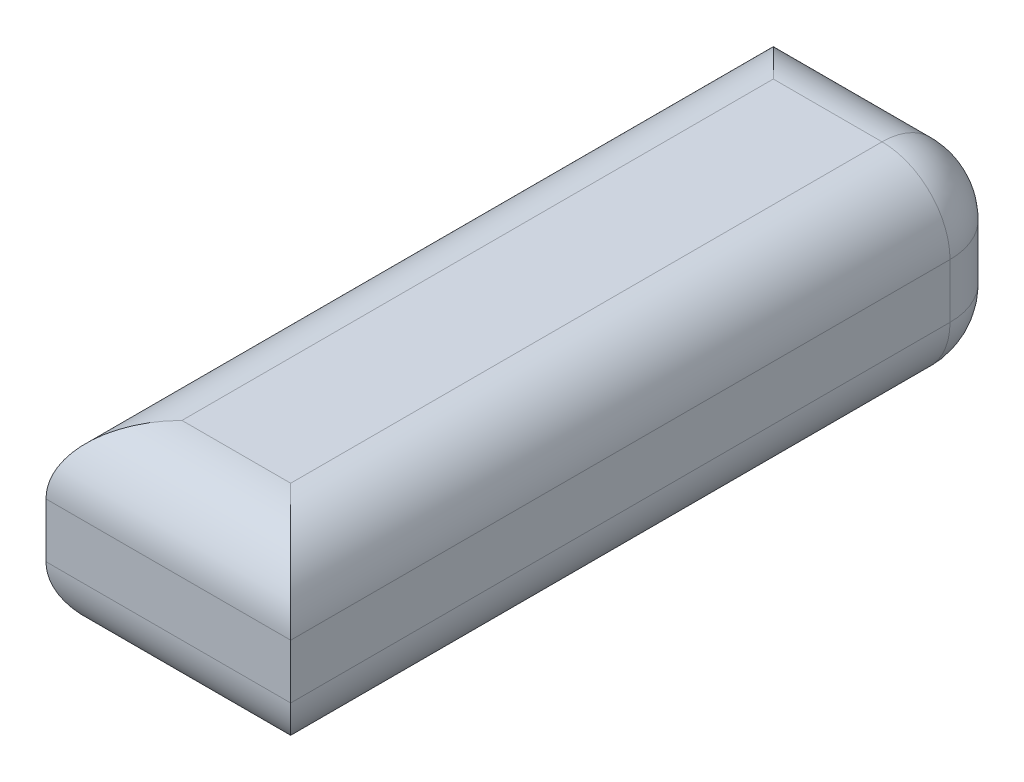
ISO-10303-21;
HEADER;
FILE_DESCRIPTION(('STEP AP214'),'2;1');
FILE_NAME('part.step','',(''),(''),'','','');
FILE_SCHEMA(('AUTOMOTIVE_DESIGN { 1 0 10303 214 1 1 1 1 }'));
ENDSEC;
DATA;
#1=APPLICATION_CONTEXT('core data for automotive mechanical design processes');
#2=APPLICATION_PROTOCOL_DEFINITION('international standard','automotive_design',2000,#1);
#3=PRODUCT_CONTEXT('',#1,'mechanical');
#4=PRODUCT('Part','Part','',(#3));
#5=PRODUCT_RELATED_PRODUCT_CATEGORY('part','',(#4));
#6=PRODUCT_DEFINITION_FORMATION('','',#4);
#7=PRODUCT_DEFINITION_CONTEXT('part definition',#1,'design');
#8=PRODUCT_DEFINITION('design','',#6,#7);
#9=PRODUCT_DEFINITION_SHAPE('','',#8);
#10=(LENGTH_UNIT() NAMED_UNIT(*) SI_UNIT(.MILLI.,.METRE.));
#11=(NAMED_UNIT(*) PLANE_ANGLE_UNIT() SI_UNIT($,.RADIAN.));
#12=(NAMED_UNIT(*) SI_UNIT($,.STERADIAN.) SOLID_ANGLE_UNIT());
#13=UNCERTAINTY_MEASURE_WITH_UNIT(LENGTH_MEASURE(1.E-05),#10,'distance_accuracy_value','');
#14=(GEOMETRIC_REPRESENTATION_CONTEXT(3) GLOBAL_UNCERTAINTY_ASSIGNED_CONTEXT((#13)) GLOBAL_UNIT_ASSIGNED_CONTEXT((#10,
#11,#12)) REPRESENTATION_CONTEXT('',''));
#15=CARTESIAN_POINT('',(0.,0.,0.));
#16=DIRECTION('',(0.,0.,1.));
#17=DIRECTION('',(1.,0.,0.));
#18=AXIS2_PLACEMENT_3D('',#15,#16,#17);
#19=CARTESIAN_POINT('',(0.,28.,0.));
#20=DIRECTION('',(1.,0.,0.));
#21=DIRECTION('',(0.,0.,-1.));
#22=AXIS2_PLACEMENT_3D('',#19,#20,#21);
#23=PLANE('',#22);
#24=DIRECTION('',(0.,-1.,0.));
#25=VECTOR('',#24,1.);
#26=CARTESIAN_POINT('',(0.,28.,-107.));
#27=LINE('',#26,#25);
#28=CARTESIAN_POINT('',(0.,18.,-107.));
#29=VERTEX_POINT('',#28);
#30=CARTESIAN_POINT('',(0.,10.,-107.));
#31=VERTEX_POINT('',#30);
#32=EDGE_CURVE('E108',#29,#31,#27,.T.);
#33=ORIENTED_EDGE('',*,*,#32,.T.);
#34=DIRECTION('',(0.,0.,1.));
#35=VECTOR('',#34,1.);
#36=CARTESIAN_POINT('',(0.,10.,0.));
#37=LINE('',#36,#35);
#38=CARTESIAN_POINT('',(0.,10.,0.));
#39=VERTEX_POINT('',#38);
#40=EDGE_CURVE('E52',#31,#39,#37,.T.);
#41=ORIENTED_EDGE('',*,*,#40,.T.);
#42=DIRECTION('',(0.,-1.,0.));
#43=VECTOR('',#42,1.);
#44=CARTESIAN_POINT('',(0.,28.,0.));
#45=LINE('',#44,#43);
#46=CARTESIAN_POINT('',(0.,18.,0.));
#47=VERTEX_POINT('',#46);
#48=EDGE_CURVE('E109',#47,#39,#45,.T.);
#49=ORIENTED_EDGE('',*,*,#48,.F.);
#50=DIRECTION('',(0.,0.,1.));
#51=VECTOR('',#50,1.);
#52=CARTESIAN_POINT('',(0.,18.,0.));
#53=LINE('',#52,#51);
#54=EDGE_CURVE('E106',#47,#29,#53,.F.);
#55=ORIENTED_EDGE('',*,*,#54,.T.);
#56=EDGE_LOOP('',(#33,#41,#49,#55));
#57=FACE_BOUND('',#56,.T.);
#58=ADVANCED_FACE('F35',(#57),#23,.F.);
#59=CARTESIAN_POINT('',(0.,28.,0.));
#60=DIRECTION('',(0.,0.,-1.));
#61=DIRECTION('',(-1.,0.,0.));
#62=AXIS2_PLACEMENT_3D('',#59,#60,#61);
#63=PLANE('',#62);
#64=ORIENTED_EDGE('',*,*,#48,.T.);
#65=DIRECTION('',(1.,0.,0.));
#66=VECTOR('',#65,1.);
#67=CARTESIAN_POINT('',(36.,10.,0.));
#68=LINE('',#67,#66);
#69=CARTESIAN_POINT('',(36.,10.,0.));
#70=VERTEX_POINT('',#69);
#71=EDGE_CURVE('E11',#39,#70,#68,.T.);
#72=ORIENTED_EDGE('',*,*,#71,.T.);
#73=DIRECTION('',(0.,-1.,0.));
#74=VECTOR('',#73,1.);
#75=CARTESIAN_POINT('',(36.,28.,0.));
#76=LINE('',#75,#74);
#77=CARTESIAN_POINT('',(36.,18.,0.));
#78=VERTEX_POINT('',#77);
#79=EDGE_CURVE('E124',#78,#70,#76,.T.);
#80=ORIENTED_EDGE('',*,*,#79,.F.);
#81=DIRECTION('',(1.,0.,0.));
#82=VECTOR('',#81,1.);
#83=CARTESIAN_POINT('',(0.,18.,0.));
#84=LINE('',#83,#82);
#85=EDGE_CURVE('E44',#78,#47,#84,.F.);
#86=ORIENTED_EDGE('',*,*,#85,.T.);
#87=EDGE_LOOP('',(#64,#72,#80,#86));
#88=FACE_BOUND('',#87,.T.);
#89=ADVANCED_FACE('F243',(#88),#63,.F.);
#90=CARTESIAN_POINT('',(36.,28.,0.));
#91=DIRECTION('',(-1.,0.,0.));
#92=DIRECTION('',(0.,0.,1.));
#93=AXIS2_PLACEMENT_3D('',#90,#91,#92);
#94=PLANE('',#93);
#95=DIRECTION('',(0.,-1.,0.));
#96=VECTOR('',#95,1.);
#97=CARTESIAN_POINT('',(36.,28.,-97.));
#98=LINE('',#97,#96);
#99=CARTESIAN_POINT('',(36.,10.,-97.));
#100=VERTEX_POINT('',#99);
#101=CARTESIAN_POINT('',(36.,18.,-97.));
#102=VERTEX_POINT('',#101);
#103=EDGE_CURVE('E143',#100,#102,#98,.F.);
#104=ORIENTED_EDGE('',*,*,#103,.T.);
#105=DIRECTION('',(0.,0.,-1.));
#106=VECTOR('',#105,1.);
#107=CARTESIAN_POINT('',(36.,18.,0.));
#108=LINE('',#107,#106);
#109=EDGE_CURVE('E149',#102,#78,#108,.F.);
#110=ORIENTED_EDGE('',*,*,#109,.T.);
#111=ORIENTED_EDGE('',*,*,#79,.T.);
#112=DIRECTION('',(0.,0.,-1.));
#113=VECTOR('',#112,1.);
#114=CARTESIAN_POINT('',(36.,10.,-107.));
#115=LINE('',#114,#113);
#116=EDGE_CURVE('E140',#70,#100,#115,.T.);
#117=ORIENTED_EDGE('',*,*,#116,.T.);
#118=EDGE_LOOP('',(#104,#110,#111,#117));
#119=FACE_BOUND('',#118,.T.);
#120=ADVANCED_FACE('F224',(#119),#94,.F.);
#121=CARTESIAN_POINT('',(0.,28.,-107.));
#122=DIRECTION('',(0.,0.,1.));
#123=DIRECTION('',(1.,0.,0.));
#124=AXIS2_PLACEMENT_3D('',#121,#122,#123);
#125=PLANE('',#124);
#126=ORIENTED_EDGE('',*,*,#32,.F.);
#127=DIRECTION('',(-1.,0.,0.));
#128=VECTOR('',#127,1.);
#129=CARTESIAN_POINT('',(0.,18.,-107.));
#130=LINE('',#129,#128);
#131=CARTESIAN_POINT('',(26.,18.,-107.));
#132=VERTEX_POINT('',#131);
#133=EDGE_CURVE('E120',#29,#132,#130,.F.);
#134=ORIENTED_EDGE('',*,*,#133,.T.);
#135=DIRECTION('',(0.,-1.,0.));
#136=VECTOR('',#135,1.);
#137=CARTESIAN_POINT('',(26.,28.,-107.));
#138=LINE('',#137,#136);
#139=CARTESIAN_POINT('',(26.,10.,-107.));
#140=VERTEX_POINT('',#139);
#141=EDGE_CURVE('E141',#132,#140,#138,.T.);
#142=ORIENTED_EDGE('',*,*,#141,.T.);
#143=DIRECTION('',(-1.,0.,0.));
#144=VECTOR('',#143,1.);
#145=CARTESIAN_POINT('',(0.,10.,-107.));
#146=LINE('',#145,#144);
#147=EDGE_CURVE('E123',#140,#31,#146,.T.);
#148=ORIENTED_EDGE('',*,*,#147,.T.);
#149=EDGE_LOOP('',(#126,#134,#142,#148));
#150=FACE_BOUND('',#149,.T.);
#151=ADVANCED_FACE('F117',(#150),#125,.F.);
#152=CARTESIAN_POINT('',(0.,28.,0.));
#153=DIRECTION('',(0.,-1.,0.));
#154=DIRECTION('',(0.,0.,-1.));
#155=AXIS2_PLACEMENT_3D('',#152,#153,#154);
#156=PLANE('',#155);
#157=DIRECTION('',(0.,0.,-1.));
#158=VECTOR('',#157,1.);
#159=CARTESIAN_POINT('',(26.,28.,0.));
#160=LINE('',#159,#158);
#161=CARTESIAN_POINT('',(26.,28.,-10.));
#162=VERTEX_POINT('',#161);
#163=CARTESIAN_POINT('',(26.,28.,-97.));
#164=VERTEX_POINT('',#163);
#165=EDGE_CURVE('E154',#162,#164,#160,.T.);
#166=ORIENTED_EDGE('',*,*,#165,.T.);
#167=DIRECTION('',(-1.,0.,0.));
#168=VECTOR('',#167,1.);
#169=CARTESIAN_POINT('',(0.,28.,-97.));
#170=LINE('',#169,#168);
#171=CARTESIAN_POINT('',(10.,28.,-97.));
#172=VERTEX_POINT('',#171);
#173=EDGE_CURVE('E156',#164,#172,#170,.T.);
#174=ORIENTED_EDGE('',*,*,#173,.T.);
#175=DIRECTION('',(0.,0.,1.));
#176=VECTOR('',#175,1.);
#177=CARTESIAN_POINT('',(10.,28.,0.));
#178=LINE('',#177,#176);
#179=CARTESIAN_POINT('',(10.,28.,-10.));
#180=VERTEX_POINT('',#179);
#181=EDGE_CURVE('E129',#172,#180,#178,.T.);
#182=ORIENTED_EDGE('',*,*,#181,.T.);
#183=DIRECTION('',(1.,0.,0.));
#184=VECTOR('',#183,1.);
#185=CARTESIAN_POINT('',(0.,28.,-10.));
#186=LINE('',#185,#184);
#187=EDGE_CURVE('E152',#180,#162,#186,.T.);
#188=ORIENTED_EDGE('',*,*,#187,.T.);
#189=EDGE_LOOP('',(#166,#174,#182,#188));
#190=FACE_BOUND('',#189,.T.);
#191=ADVANCED_FACE('F199',(#190),#156,.F.);
#192=CARTESIAN_POINT('',(0.,0.,0.));
#193=DIRECTION('',(0.,-1.,0.));
#194=DIRECTION('',(0.,0.,-1.));
#195=AXIS2_PLACEMENT_3D('',#192,#193,#194);
#196=PLANE('',#195);
#197=DIRECTION('',(-1.,0.,0.));
#198=VECTOR('',#197,1.);
#199=CARTESIAN_POINT('',(36.,0.,-97.));
#200=LINE('',#199,#198);
#201=CARTESIAN_POINT('',(10.,0.,-97.));
#202=VERTEX_POINT('',#201);
#203=CARTESIAN_POINT('',(26.,0.,-97.));
#204=VERTEX_POINT('',#203);
#205=EDGE_CURVE('E162',#202,#204,#200,.F.);
#206=ORIENTED_EDGE('',*,*,#205,.T.);
#207=DIRECTION('',(0.,0.,-1.));
#208=VECTOR('',#207,1.);
#209=CARTESIAN_POINT('',(26.,0.,0.));
#210=LINE('',#209,#208);
#211=CARTESIAN_POINT('',(26.,0.,-10.));
#212=VERTEX_POINT('',#211);
#213=EDGE_CURVE('E114',#204,#212,#210,.F.);
#214=ORIENTED_EDGE('',*,*,#213,.T.);
#215=DIRECTION('',(1.,0.,0.));
#216=VECTOR('',#215,1.);
#217=CARTESIAN_POINT('',(0.,0.,-10.));
#218=LINE('',#217,#216);
#219=CARTESIAN_POINT('',(10.,0.,-10.));
#220=VERTEX_POINT('',#219);
#221=EDGE_CURVE('E158',#212,#220,#218,.F.);
#222=ORIENTED_EDGE('',*,*,#221,.T.);
#223=DIRECTION('',(0.,0.,1.));
#224=VECTOR('',#223,1.);
#225=CARTESIAN_POINT('',(10.,0.,-107.));
#226=LINE('',#225,#224);
#227=EDGE_CURVE('E160',#220,#202,#226,.F.);
#228=ORIENTED_EDGE('',*,*,#227,.T.);
#229=EDGE_LOOP('',(#206,#214,#222,#228));
#230=FACE_BOUND('',#229,.T.);
#231=ADVANCED_FACE('F231',(#230),#196,.T.);
#232=CARTESIAN_POINT('',(0.,18.,-10.));
#233=DIRECTION('',(1.,0.,0.));
#234=DIRECTION('',(0.,0.,-1.));
#235=AXIS2_PLACEMENT_3D('',#232,#233,#234);
#236=CYLINDRICAL_SURFACE('',#235,10.);
#237=CARTESIAN_POINT('',(26.,18.,-10.));
#238=DIRECTION('',(0.707106781186547,0.,-0.707106781186547));
#239=DIRECTION('',(0.707106781186547,0.,0.707106781186547));
#240=AXIS2_PLACEMENT_3D('',#237,#238,#239);
#241=ELLIPSE('',#240,14.1421356237309,10.);
#242=EDGE_CURVE('E133',#162,#78,#241,.T.);
#243=ORIENTED_EDGE('',*,*,#242,.F.);
#244=ORIENTED_EDGE('',*,*,#187,.F.);
#245=CARTESIAN_POINT('',(10.,18.,-10.));
#246=DIRECTION('',(0.707106781186547,0.,0.707106781186547));
#247=DIRECTION('',(-0.707106781186547,0.,0.707106781186547));
#248=AXIS2_PLACEMENT_3D('',#245,#246,#247);
#249=ELLIPSE('',#248,14.1421356237309,10.);
#250=EDGE_CURVE('E39',#47,#180,#249,.F.);
#251=ORIENTED_EDGE('',*,*,#250,.F.);
#252=ORIENTED_EDGE('',*,*,#85,.F.);
#253=EDGE_LOOP('',(#243,#244,#251,#252));
#254=FACE_BOUND('',#253,.T.);
#255=ADVANCED_FACE('F37',(#254),#236,.T.);
#256=CARTESIAN_POINT('',(10.,18.,0.));
#257=DIRECTION('',(0.,0.,1.));
#258=DIRECTION('',(1.,0.,0.));
#259=AXIS2_PLACEMENT_3D('',#256,#257,#258);
#260=CYLINDRICAL_SURFACE('',#259,10.);
#261=ORIENTED_EDGE('',*,*,#250,.T.);
#262=ORIENTED_EDGE('',*,*,#181,.F.);
#263=CARTESIAN_POINT('',(10.,18.,-97.));
#264=DIRECTION('',(-0.707106781186547,0.,0.707106781186547));
#265=DIRECTION('',(0.707106781186547,0.,0.707106781186547));
#266=AXIS2_PLACEMENT_3D('',#263,#264,#265);
#267=ELLIPSE('',#266,14.1421356237309,10.);
#268=EDGE_CURVE('E127',#29,#172,#267,.F.);
#269=ORIENTED_EDGE('',*,*,#268,.F.);
#270=ORIENTED_EDGE('',*,*,#54,.F.);
#271=EDGE_LOOP('',(#261,#262,#269,#270));
#272=FACE_BOUND('',#271,.T.);
#273=ADVANCED_FACE('F128',(#272),#260,.T.);
#274=CARTESIAN_POINT('',(10.,10.,0.));
#275=DIRECTION('',(0.,0.,-1.));
#276=DIRECTION('',(-1.,0.,0.));
#277=AXIS2_PLACEMENT_3D('',#274,#275,#276);
#278=CYLINDRICAL_SURFACE('',#277,10.);
#279=CARTESIAN_POINT('',(10.,10.,-97.));
#280=DIRECTION('',(0.707106781186547,0.,-0.707106781186547));
#281=DIRECTION('',(-0.707106781186547,0.,-0.707106781186547));
#282=AXIS2_PLACEMENT_3D('',#279,#280,#281);
#283=ELLIPSE('',#282,14.1421356237309,10.);
#284=EDGE_CURVE('E134',#202,#31,#283,.T.);
#285=ORIENTED_EDGE('',*,*,#284,.F.);
#286=ORIENTED_EDGE('',*,*,#227,.F.);
#287=CARTESIAN_POINT('',(10.,10.,-10.));
#288=DIRECTION('',(-0.707106781186547,0.,-0.707106781186547));
#289=DIRECTION('',(-0.707106781186547,0.,0.707106781186547));
#290=AXIS2_PLACEMENT_3D('',#287,#288,#289);
#291=ELLIPSE('',#290,14.1421356237309,10.);
#292=EDGE_CURVE('E188',#39,#220,#291,.F.);
#293=ORIENTED_EDGE('',*,*,#292,.F.);
#294=ORIENTED_EDGE('',*,*,#40,.F.);
#295=EDGE_LOOP('',(#285,#286,#293,#294));
#296=FACE_BOUND('',#295,.T.);
#297=ADVANCED_FACE('F234',(#296),#278,.T.);
#298=CARTESIAN_POINT('',(0.,10.,-10.));
#299=DIRECTION('',(-1.,0.,0.));
#300=DIRECTION('',(0.,0.,1.));
#301=AXIS2_PLACEMENT_3D('',#298,#299,#300);
#302=CYLINDRICAL_SURFACE('',#301,10.);
#303=ORIENTED_EDGE('',*,*,#292,.T.);
#304=ORIENTED_EDGE('',*,*,#221,.F.);
#305=CARTESIAN_POINT('',(26.,10.,-10.));
#306=DIRECTION('',(-0.707106781186547,0.,0.707106781186547));
#307=DIRECTION('',(-0.707106781186547,0.,-0.707106781186547));
#308=AXIS2_PLACEMENT_3D('',#305,#306,#307);
#309=ELLIPSE('',#308,14.1421356237309,10.);
#310=EDGE_CURVE('E183',#70,#212,#309,.F.);
#311=ORIENTED_EDGE('',*,*,#310,.F.);
#312=ORIENTED_EDGE('',*,*,#71,.F.);
#313=EDGE_LOOP('',(#303,#304,#311,#312));
#314=FACE_BOUND('',#313,.T.);
#315=ADVANCED_FACE('F226',(#314),#302,.T.);
#316=CARTESIAN_POINT('',(26.,18.,0.));
#317=DIRECTION('',(0.,0.,-1.));
#318=DIRECTION('',(-1.,0.,0.));
#319=AXIS2_PLACEMENT_3D('',#316,#317,#318);
#320=CYLINDRICAL_SURFACE('',#319,10.);
#321=ORIENTED_EDGE('',*,*,#242,.T.);
#322=ORIENTED_EDGE('',*,*,#109,.F.);
#323=CARTESIAN_POINT('',(26.,18.,-97.));
#324=DIRECTION('',(0.,0.,-1.));
#325=DIRECTION('',(-1.,0.,0.));
#326=AXIS2_PLACEMENT_3D('',#323,#324,#325);
#327=CIRCLE('',#326,10.);
#328=EDGE_CURVE('E180',#164,#102,#327,.T.);
#329=ORIENTED_EDGE('',*,*,#328,.F.);
#330=ORIENTED_EDGE('',*,*,#165,.F.);
#331=EDGE_LOOP('',(#321,#322,#329,#330));
#332=FACE_BOUND('',#331,.T.);
#333=ADVANCED_FACE('F203',(#332),#320,.T.);
#334=CARTESIAN_POINT('',(0.,18.,-97.));
#335=DIRECTION('',(-1.,0.,0.));
#336=DIRECTION('',(0.,0.,1.));
#337=AXIS2_PLACEMENT_3D('',#334,#335,#336);
#338=CYLINDRICAL_SURFACE('',#337,10.);
#339=ORIENTED_EDGE('',*,*,#268,.T.);
#340=ORIENTED_EDGE('',*,*,#173,.F.);
#341=CARTESIAN_POINT('',(26.,18.,-97.));
#342=DIRECTION('',(1.,0.,0.));
#343=DIRECTION('',(0.,0.,-1.));
#344=AXIS2_PLACEMENT_3D('',#341,#342,#343);
#345=CIRCLE('',#344,10.);
#346=EDGE_CURVE('E138',#132,#164,#345,.T.);
#347=ORIENTED_EDGE('',*,*,#346,.F.);
#348=ORIENTED_EDGE('',*,*,#133,.F.);
#349=EDGE_LOOP('',(#339,#340,#347,#348));
#350=FACE_BOUND('',#349,.T.);
#351=ADVANCED_FACE('F136',(#350),#338,.T.);
#352=CARTESIAN_POINT('',(0.,10.,-97.));
#353=DIRECTION('',(1.,0.,0.));
#354=DIRECTION('',(0.,0.,-1.));
#355=AXIS2_PLACEMENT_3D('',#352,#353,#354);
#356=CYLINDRICAL_SURFACE('',#355,10.);
#357=ORIENTED_EDGE('',*,*,#284,.T.);
#358=ORIENTED_EDGE('',*,*,#147,.F.);
#359=CARTESIAN_POINT('',(26.,10.,-97.));
#360=DIRECTION('',(1.,0.,0.));
#361=DIRECTION('',(0.,0.,-1.));
#362=AXIS2_PLACEMENT_3D('',#359,#360,#361);
#363=CIRCLE('',#362,10.);
#364=EDGE_CURVE('E176',#204,#140,#363,.T.);
#365=ORIENTED_EDGE('',*,*,#364,.F.);
#366=ORIENTED_EDGE('',*,*,#205,.F.);
#367=EDGE_LOOP('',(#357,#358,#365,#366));
#368=FACE_BOUND('',#367,.T.);
#369=ADVANCED_FACE('F217',(#368),#356,.T.);
#370=CARTESIAN_POINT('',(26.,10.,0.));
#371=DIRECTION('',(0.,0.,1.));
#372=DIRECTION('',(1.,0.,0.));
#373=AXIS2_PLACEMENT_3D('',#370,#371,#372);
#374=CYLINDRICAL_SURFACE('',#373,10.);
#375=ORIENTED_EDGE('',*,*,#310,.T.);
#376=ORIENTED_EDGE('',*,*,#213,.F.);
#377=CARTESIAN_POINT('',(26.,10.,-97.));
#378=DIRECTION('',(0.,0.,-1.));
#379=DIRECTION('',(-1.,0.,0.));
#380=AXIS2_PLACEMENT_3D('',#377,#378,#379);
#381=CIRCLE('',#380,10.);
#382=EDGE_CURVE('E173',#100,#204,#381,.T.);
#383=ORIENTED_EDGE('',*,*,#382,.F.);
#384=ORIENTED_EDGE('',*,*,#116,.F.);
#385=EDGE_LOOP('',(#375,#376,#383,#384));
#386=FACE_BOUND('',#385,.T.);
#387=ADVANCED_FACE('F229',(#386),#374,.T.);
#388=CARTESIAN_POINT('',(26.,18.,-97.));
#389=DIRECTION('',(0.,0.,1.));
#390=DIRECTION('',(1.,0.,0.));
#391=AXIS2_PLACEMENT_3D('',#388,#389,#390);
#392=SPHERICAL_SURFACE('',#391,10.);
#393=ORIENTED_EDGE('',*,*,#346,.T.);
#394=ORIENTED_EDGE('',*,*,#328,.T.);
#395=CARTESIAN_POINT('',(26.,18.,-97.));
#396=DIRECTION('',(0.,1.,0.));
#397=DIRECTION('',(0.,0.,1.));
#398=AXIS2_PLACEMENT_3D('',#395,#396,#397);
#399=CIRCLE('',#398,10.);
#400=EDGE_CURVE('E170',#132,#102,#399,.F.);
#401=ORIENTED_EDGE('',*,*,#400,.F.);
#402=EDGE_LOOP('',(#393,#394,#401));
#403=FACE_BOUND('',#402,.T.);
#404=ADVANCED_FACE('F205',(#403),#392,.T.);
#405=CARTESIAN_POINT('',(26.,10.,-97.));
#406=DIRECTION('',(0.,0.,1.));
#407=DIRECTION('',(1.,0.,0.));
#408=AXIS2_PLACEMENT_3D('',#405,#406,#407);
#409=SPHERICAL_SURFACE('',#408,10.);
#410=ORIENTED_EDGE('',*,*,#382,.T.);
#411=ORIENTED_EDGE('',*,*,#364,.T.);
#412=CARTESIAN_POINT('',(26.,10.,-97.));
#413=DIRECTION('',(0.,-1.,0.));
#414=DIRECTION('',(0.,0.,-1.));
#415=AXIS2_PLACEMENT_3D('',#412,#413,#414);
#416=CIRCLE('',#415,10.);
#417=EDGE_CURVE('E168',#100,#140,#416,.F.);
#418=ORIENTED_EDGE('',*,*,#417,.F.);
#419=EDGE_LOOP('',(#410,#411,#418));
#420=FACE_BOUND('',#419,.T.);
#421=ADVANCED_FACE('F213',(#420),#409,.T.);
#422=CARTESIAN_POINT('',(26.,28.,-97.));
#423=DIRECTION('',(0.,-1.,0.));
#424=DIRECTION('',(0.,0.,-1.));
#425=AXIS2_PLACEMENT_3D('',#422,#423,#424);
#426=CYLINDRICAL_SURFACE('',#425,10.);
#427=ORIENTED_EDGE('',*,*,#400,.T.);
#428=ORIENTED_EDGE('',*,*,#103,.F.);
#429=ORIENTED_EDGE('',*,*,#417,.T.);
#430=ORIENTED_EDGE('',*,*,#141,.F.);
#431=EDGE_LOOP('',(#427,#428,#429,#430));
#432=FACE_BOUND('',#431,.T.);
#433=ADVANCED_FACE('F209',(#432),#426,.T.);
#434=CLOSED_SHELL('',(#58,#89,#120,#151,#191,#231,#255,#273,#297,#315,#333,#351,#369,#387,#404,
#421,#433));
#435=MANIFOLD_SOLID_BREP('B2',#434);
#436=ADVANCED_BREP_SHAPE_REPRESENTATION('',(#18,#435),#14);
#437=SHAPE_DEFINITION_REPRESENTATION(#9,#436);
ENDSEC;
END-ISO-10303-21;
